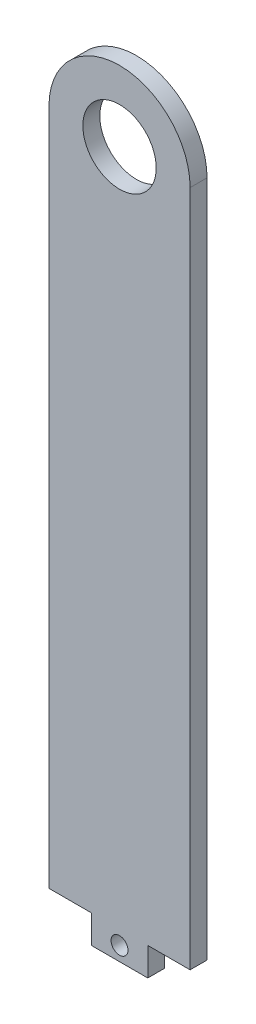
ISO-10303-21;
HEADER;
FILE_DESCRIPTION(('STEP AP214'),'2;1');
FILE_NAME('part.step','',(''),(''),'','','');
FILE_SCHEMA(('AUTOMOTIVE_DESIGN { 1 0 10303 214 1 1 1 1 }'));
ENDSEC;
DATA;
#1=APPLICATION_CONTEXT('core data for automotive mechanical design processes');
#2=APPLICATION_PROTOCOL_DEFINITION('international standard','automotive_design',2000,#1);
#3=PRODUCT_CONTEXT('',#1,'mechanical');
#4=PRODUCT('Part','Part','',(#3));
#5=PRODUCT_RELATED_PRODUCT_CATEGORY('part','',(#4));
#6=PRODUCT_DEFINITION_FORMATION('','',#4);
#7=PRODUCT_DEFINITION_CONTEXT('part definition',#1,'design');
#8=PRODUCT_DEFINITION('design','',#6,#7);
#9=PRODUCT_DEFINITION_SHAPE('','',#8);
#10=(LENGTH_UNIT() NAMED_UNIT(*) SI_UNIT(.MILLI.,.METRE.));
#11=(NAMED_UNIT(*) PLANE_ANGLE_UNIT() SI_UNIT($,.RADIAN.));
#12=(NAMED_UNIT(*) SI_UNIT($,.STERADIAN.) SOLID_ANGLE_UNIT());
#13=UNCERTAINTY_MEASURE_WITH_UNIT(LENGTH_MEASURE(1.E-05),#10,'distance_accuracy_value','');
#14=(GEOMETRIC_REPRESENTATION_CONTEXT(3) GLOBAL_UNCERTAINTY_ASSIGNED_CONTEXT((#13)) GLOBAL_UNIT_ASSIGNED_CONTEXT((#10,
#11,#12)) REPRESENTATION_CONTEXT('',''));
#15=CARTESIAN_POINT('',(0.,0.,0.));
#16=DIRECTION('',(0.,0.,1.));
#17=DIRECTION('',(1.,0.,0.));
#18=AXIS2_PLACEMENT_3D('',#15,#16,#17);
#19=CARTESIAN_POINT('',(-25.,-120.,6.));
#20=DIRECTION('',(0.,1.,0.));
#21=DIRECTION('',(0.,0.,1.));
#22=AXIS2_PLACEMENT_3D('',#19,#20,#21);
#23=PLANE('',#22);
#24=DIRECTION('',(0.,0.,-1.));
#25=VECTOR('',#24,1.);
#26=CARTESIAN_POINT('',(-10.,-120.,6.));
#27=LINE('',#26,#25);
#28=CARTESIAN_POINT('',(-10.,-120.,6.));
#29=VERTEX_POINT('',#28);
#30=CARTESIAN_POINT('',(-10.,-120.,0.));
#31=VERTEX_POINT('',#30);
#32=EDGE_CURVE('E109',#29,#31,#27,.T.);
#33=ORIENTED_EDGE('',*,*,#32,.F.);
#34=DIRECTION('',(1.,0.,0.));
#35=VECTOR('',#34,1.);
#36=CARTESIAN_POINT('',(-25.,-120.,6.));
#37=LINE('',#36,#35);
#38=CARTESIAN_POINT('',(-25.,-120.,6.));
#39=VERTEX_POINT('',#38);
#40=EDGE_CURVE('E122',#39,#29,#37,.T.);
#41=ORIENTED_EDGE('',*,*,#40,.F.);
#42=DIRECTION('',(0.,0.,-1.));
#43=VECTOR('',#42,1.);
#44=CARTESIAN_POINT('',(-25.,-120.,6.));
#45=LINE('',#44,#43);
#46=CARTESIAN_POINT('',(-25.,-120.,0.));
#47=VERTEX_POINT('',#46);
#48=EDGE_CURVE('E40',#39,#47,#45,.T.);
#49=ORIENTED_EDGE('',*,*,#48,.T.);
#50=DIRECTION('',(1.,0.,0.));
#51=VECTOR('',#50,1.);
#52=CARTESIAN_POINT('',(-25.,-120.,0.));
#53=LINE('',#52,#51);
#54=EDGE_CURVE('E124',#47,#31,#53,.T.);
#55=ORIENTED_EDGE('',*,*,#54,.T.);
#56=EDGE_LOOP('',(#33,#41,#49,#55));
#57=FACE_BOUND('',#56,.T.);
#58=ADVANCED_FACE('F32',(#57),#23,.F.);
#59=CARTESIAN_POINT('',(0.,120.,6.));
#60=DIRECTION('',(0.,0.,1.));
#61=DIRECTION('',(1.,0.,0.));
#62=AXIS2_PLACEMENT_3D('',#59,#60,#61);
#63=PLANE('',#62);
#64=CARTESIAN_POINT('',(0.,120.,6.));
#65=DIRECTION('',(0.,0.,1.));
#66=DIRECTION('',(1.,0.,0.));
#67=AXIS2_PLACEMENT_3D('',#64,#65,#66);
#68=CIRCLE('',#67,25.);
#69=CARTESIAN_POINT('',(25.,120.,6.));
#70=VERTEX_POINT('',#69);
#71=CARTESIAN_POINT('',(-25.,120.,6.));
#72=VERTEX_POINT('',#71);
#73=EDGE_CURVE('E146',#70,#72,#68,.T.);
#74=ORIENTED_EDGE('',*,*,#73,.T.);
#75=DIRECTION('',(0.,-1.,0.));
#76=VECTOR('',#75,1.);
#77=CARTESIAN_POINT('',(-25.,-120.,6.));
#78=LINE('',#77,#76);
#79=EDGE_CURVE('E84',#72,#39,#78,.T.);
#80=ORIENTED_EDGE('',*,*,#79,.T.);
#81=ORIENTED_EDGE('',*,*,#40,.T.);
#82=DIRECTION('',(0.,1.,0.));
#83=VECTOR('',#82,1.);
#84=CARTESIAN_POINT('',(-10.,-130.,6.));
#85=LINE('',#84,#83);
#86=CARTESIAN_POINT('',(-10.,-130.,6.));
#87=VERTEX_POINT('',#86);
#88=EDGE_CURVE('E105',#87,#29,#85,.T.);
#89=ORIENTED_EDGE('',*,*,#88,.F.);
#90=DIRECTION('',(-1.,0.,0.));
#91=VECTOR('',#90,1.);
#92=CARTESIAN_POINT('',(10.,-130.,6.));
#93=LINE('',#92,#91);
#94=CARTESIAN_POINT('',(10.,-130.,6.));
#95=VERTEX_POINT('',#94);
#96=EDGE_CURVE('E126',#95,#87,#93,.T.);
#97=ORIENTED_EDGE('',*,*,#96,.F.);
#98=DIRECTION('',(0.,-1.,0.));
#99=VECTOR('',#98,1.);
#100=CARTESIAN_POINT('',(10.,-130.,6.));
#101=LINE('',#100,#99);
#102=CARTESIAN_POINT('',(10.,-120.,6.));
#103=VERTEX_POINT('',#102);
#104=EDGE_CURVE('E115',#103,#95,#101,.T.);
#105=ORIENTED_EDGE('',*,*,#104,.F.);
#106=CARTESIAN_POINT('',(25.,-120.,6.));
#107=VERTEX_POINT('',#106);
#108=EDGE_CURVE('E130',#103,#107,#37,.T.);
#109=ORIENTED_EDGE('',*,*,#108,.T.);
#110=DIRECTION('',(0.,1.,0.));
#111=VECTOR('',#110,1.);
#112=CARTESIAN_POINT('',(25.,-120.,6.));
#113=LINE('',#112,#111);
#114=EDGE_CURVE('E56',#107,#70,#113,.T.);
#115=ORIENTED_EDGE('',*,*,#114,.T.);
#116=EDGE_LOOP('',(#74,#80,#81,#89,#97,#105,#109,#115));
#117=FACE_BOUND('',#116,.T.);
#118=CARTESIAN_POINT('',(0.,120.,6.));
#119=DIRECTION('',(0.,0.,1.));
#120=DIRECTION('',(1.,0.,0.));
#121=AXIS2_PLACEMENT_3D('',#118,#119,#120);
#122=CIRCLE('',#121,13.);
#123=CARTESIAN_POINT('',(13.,120.,6.));
#124=VERTEX_POINT('',#123);
#125=EDGE_CURVE('E141',#124,#124,#122,.T.);
#126=ORIENTED_EDGE('',*,*,#125,.F.);
#127=EDGE_LOOP('',(#126));
#128=FACE_BOUND('',#127,.T.);
#129=CARTESIAN_POINT('',(0.,-125.,6.));
#130=DIRECTION('',(0.,0.,-1.));
#131=DIRECTION('',(-1.,0.,0.));
#132=AXIS2_PLACEMENT_3D('',#129,#130,#131);
#133=CIRCLE('',#132,3.);
#134=CARTESIAN_POINT('',(-3.,-125.,6.));
#135=VERTEX_POINT('',#134);
#136=EDGE_CURVE('E156',#135,#135,#133,.T.);
#137=ORIENTED_EDGE('',*,*,#136,.T.);
#138=EDGE_LOOP('',(#137));
#139=FACE_BOUND('',#138,.T.);
#140=ADVANCED_FACE('F128',(#117,#128,#139),#63,.T.);
#141=CARTESIAN_POINT('',(0.,120.,0.));
#142=DIRECTION('',(0.,0.,1.));
#143=DIRECTION('',(1.,0.,0.));
#144=AXIS2_PLACEMENT_3D('',#141,#142,#143);
#145=PLANE('',#144);
#146=CARTESIAN_POINT('',(0.,120.,0.));
#147=DIRECTION('',(0.,0.,1.));
#148=DIRECTION('',(1.,0.,0.));
#149=AXIS2_PLACEMENT_3D('',#146,#147,#148);
#150=CIRCLE('',#149,25.);
#151=CARTESIAN_POINT('',(25.,120.,0.));
#152=VERTEX_POINT('',#151);
#153=CARTESIAN_POINT('',(-25.,120.,0.));
#154=VERTEX_POINT('',#153);
#155=EDGE_CURVE('E137',#152,#154,#150,.T.);
#156=ORIENTED_EDGE('',*,*,#155,.F.);
#157=DIRECTION('',(0.,1.,0.));
#158=VECTOR('',#157,1.);
#159=CARTESIAN_POINT('',(25.,-120.,0.));
#160=LINE('',#159,#158);
#161=CARTESIAN_POINT('',(25.,-120.,0.));
#162=VERTEX_POINT('',#161);
#163=EDGE_CURVE('E77',#162,#152,#160,.T.);
#164=ORIENTED_EDGE('',*,*,#163,.F.);
#165=CARTESIAN_POINT('',(10.,-120.,0.));
#166=VERTEX_POINT('',#165);
#167=EDGE_CURVE('E143',#166,#162,#53,.T.);
#168=ORIENTED_EDGE('',*,*,#167,.F.);
#169=DIRECTION('',(0.,-1.,0.));
#170=VECTOR('',#169,1.);
#171=CARTESIAN_POINT('',(10.,-130.,0.));
#172=LINE('',#171,#170);
#173=CARTESIAN_POINT('',(10.,-130.,0.));
#174=VERTEX_POINT('',#173);
#175=EDGE_CURVE('E47',#166,#174,#172,.T.);
#176=ORIENTED_EDGE('',*,*,#175,.T.);
#177=DIRECTION('',(-1.,0.,0.));
#178=VECTOR('',#177,1.);
#179=CARTESIAN_POINT('',(10.,-130.,0.));
#180=LINE('',#179,#178);
#181=CARTESIAN_POINT('',(-10.,-130.,0.));
#182=VERTEX_POINT('',#181);
#183=EDGE_CURVE('E116',#174,#182,#180,.T.);
#184=ORIENTED_EDGE('',*,*,#183,.T.);
#185=DIRECTION('',(0.,1.,0.));
#186=VECTOR('',#185,1.);
#187=CARTESIAN_POINT('',(-10.,-130.,0.));
#188=LINE('',#187,#186);
#189=EDGE_CURVE('E154',#182,#31,#188,.T.);
#190=ORIENTED_EDGE('',*,*,#189,.T.);
#191=ORIENTED_EDGE('',*,*,#54,.F.);
#192=DIRECTION('',(0.,-1.,0.));
#193=VECTOR('',#192,1.);
#194=CARTESIAN_POINT('',(-25.,-120.,0.));
#195=LINE('',#194,#193);
#196=EDGE_CURVE('E140',#154,#47,#195,.T.);
#197=ORIENTED_EDGE('',*,*,#196,.F.);
#198=EDGE_LOOP('',(#156,#164,#168,#176,#184,#190,#191,#197));
#199=FACE_BOUND('',#198,.T.);
#200=CARTESIAN_POINT('',(0.,120.,0.));
#201=DIRECTION('',(0.,0.,1.));
#202=DIRECTION('',(1.,0.,0.));
#203=AXIS2_PLACEMENT_3D('',#200,#201,#202);
#204=CIRCLE('',#203,13.);
#205=CARTESIAN_POINT('',(13.,120.,0.));
#206=VERTEX_POINT('',#205);
#207=EDGE_CURVE('E167',#206,#206,#204,.T.);
#208=ORIENTED_EDGE('',*,*,#207,.T.);
#209=EDGE_LOOP('',(#208));
#210=FACE_BOUND('',#209,.T.);
#211=CARTESIAN_POINT('',(0.,-125.,0.));
#212=DIRECTION('',(0.,0.,-1.));
#213=DIRECTION('',(-1.,0.,0.));
#214=AXIS2_PLACEMENT_3D('',#211,#212,#213);
#215=CIRCLE('',#214,3.);
#216=CARTESIAN_POINT('',(-3.,-125.,0.));
#217=VERTEX_POINT('',#216);
#218=EDGE_CURVE('E160',#217,#217,#215,.T.);
#219=ORIENTED_EDGE('',*,*,#218,.F.);
#220=EDGE_LOOP('',(#219));
#221=FACE_BOUND('',#220,.T.);
#222=ADVANCED_FACE('F151',(#199,#210,#221),#145,.F.);
#223=CARTESIAN_POINT('',(0.,120.,6.));
#224=DIRECTION('',(0.,0.,-1.));
#225=DIRECTION('',(-1.,0.,0.));
#226=AXIS2_PLACEMENT_3D('',#223,#224,#225);
#227=CYLINDRICAL_SURFACE('',#226,25.);
#228=ORIENTED_EDGE('',*,*,#155,.T.);
#229=DIRECTION('',(0.,0.,-1.));
#230=VECTOR('',#229,1.);
#231=CARTESIAN_POINT('',(-25.,120.,6.));
#232=LINE('',#231,#230);
#233=EDGE_CURVE('E11',#72,#154,#232,.T.);
#234=ORIENTED_EDGE('',*,*,#233,.F.);
#235=ORIENTED_EDGE('',*,*,#73,.F.);
#236=DIRECTION('',(0.,0.,-1.));
#237=VECTOR('',#236,1.);
#238=CARTESIAN_POINT('',(25.,120.,6.));
#239=LINE('',#238,#237);
#240=EDGE_CURVE('E132',#70,#152,#239,.T.);
#241=ORIENTED_EDGE('',*,*,#240,.T.);
#242=EDGE_LOOP('',(#228,#234,#235,#241));
#243=FACE_BOUND('',#242,.T.);
#244=ADVANCED_FACE('F34',(#243),#227,.T.);
#245=CARTESIAN_POINT('',(-25.,-120.,6.));
#246=DIRECTION('',(1.,0.,0.));
#247=DIRECTION('',(0.,0.,-1.));
#248=AXIS2_PLACEMENT_3D('',#245,#246,#247);
#249=PLANE('',#248);
#250=ORIENTED_EDGE('',*,*,#196,.T.);
#251=ORIENTED_EDGE('',*,*,#48,.F.);
#252=ORIENTED_EDGE('',*,*,#79,.F.);
#253=ORIENTED_EDGE('',*,*,#233,.T.);
#254=EDGE_LOOP('',(#250,#251,#252,#253));
#255=FACE_BOUND('',#254,.T.);
#256=ADVANCED_FACE('F177',(#255),#249,.F.);
#257=ORIENTED_EDGE('',*,*,#108,.F.);
#258=DIRECTION('',(0.,0.,-1.));
#259=VECTOR('',#258,1.);
#260=CARTESIAN_POINT('',(10.,-120.,6.));
#261=LINE('',#260,#259);
#262=EDGE_CURVE('E125',#103,#166,#261,.T.);
#263=ORIENTED_EDGE('',*,*,#262,.T.);
#264=ORIENTED_EDGE('',*,*,#167,.T.);
#265=DIRECTION('',(0.,0.,-1.));
#266=VECTOR('',#265,1.);
#267=CARTESIAN_POINT('',(25.,-120.,6.));
#268=LINE('',#267,#266);
#269=EDGE_CURVE('E148',#107,#162,#268,.T.);
#270=ORIENTED_EDGE('',*,*,#269,.F.);
#271=EDGE_LOOP('',(#257,#263,#264,#270));
#272=FACE_BOUND('',#271,.T.);
#273=ADVANCED_FACE('F179',(#272),#23,.F.);
#274=CARTESIAN_POINT('',(25.,-120.,6.));
#275=DIRECTION('',(-1.,0.,0.));
#276=DIRECTION('',(0.,0.,1.));
#277=AXIS2_PLACEMENT_3D('',#274,#275,#276);
#278=PLANE('',#277);
#279=ORIENTED_EDGE('',*,*,#163,.T.);
#280=ORIENTED_EDGE('',*,*,#240,.F.);
#281=ORIENTED_EDGE('',*,*,#114,.F.);
#282=ORIENTED_EDGE('',*,*,#269,.T.);
#283=EDGE_LOOP('',(#279,#280,#281,#282));
#284=FACE_BOUND('',#283,.T.);
#285=ADVANCED_FACE('F184',(#284),#278,.F.);
#286=CARTESIAN_POINT('',(0.,120.,6.));
#287=DIRECTION('',(0.,0.,-1.));
#288=DIRECTION('',(-1.,0.,0.));
#289=AXIS2_PLACEMENT_3D('',#286,#287,#288);
#290=CYLINDRICAL_SURFACE('',#289,13.);
#291=ORIENTED_EDGE('',*,*,#125,.T.);
#292=EDGE_LOOP('',(#291));
#293=FACE_BOUND('',#292,.T.);
#294=ORIENTED_EDGE('',*,*,#207,.F.);
#295=EDGE_LOOP('',(#294));
#296=FACE_BOUND('',#295,.T.);
#297=ADVANCED_FACE('F195',(#293,#296),#290,.F.);
#298=CARTESIAN_POINT('',(-10.,-130.,6.));
#299=DIRECTION('',(-1.,0.,0.));
#300=DIRECTION('',(0.,0.,1.));
#301=AXIS2_PLACEMENT_3D('',#298,#299,#300);
#302=PLANE('',#301);
#303=ORIENTED_EDGE('',*,*,#189,.F.);
#304=DIRECTION('',(0.,0.,-1.));
#305=VECTOR('',#304,1.);
#306=CARTESIAN_POINT('',(-10.,-130.,6.));
#307=LINE('',#306,#305);
#308=EDGE_CURVE('E111',#87,#182,#307,.T.);
#309=ORIENTED_EDGE('',*,*,#308,.F.);
#310=ORIENTED_EDGE('',*,*,#88,.T.);
#311=ORIENTED_EDGE('',*,*,#32,.T.);
#312=EDGE_LOOP('',(#303,#309,#310,#311));
#313=FACE_BOUND('',#312,.T.);
#314=ADVANCED_FACE('F108',(#313),#302,.T.);
#315=CARTESIAN_POINT('',(10.,-130.,6.));
#316=DIRECTION('',(0.,-1.,0.));
#317=DIRECTION('',(0.,0.,-1.));
#318=AXIS2_PLACEMENT_3D('',#315,#316,#317);
#319=PLANE('',#318);
#320=ORIENTED_EDGE('',*,*,#183,.F.);
#321=DIRECTION('',(0.,0.,-1.));
#322=VECTOR('',#321,1.);
#323=CARTESIAN_POINT('',(10.,-130.,6.));
#324=LINE('',#323,#322);
#325=EDGE_CURVE('E168',#95,#174,#324,.T.);
#326=ORIENTED_EDGE('',*,*,#325,.F.);
#327=ORIENTED_EDGE('',*,*,#96,.T.);
#328=ORIENTED_EDGE('',*,*,#308,.T.);
#329=EDGE_LOOP('',(#320,#326,#327,#328));
#330=FACE_BOUND('',#329,.T.);
#331=ADVANCED_FACE('F203',(#330),#319,.T.);
#332=CARTESIAN_POINT('',(10.,-130.,6.));
#333=DIRECTION('',(1.,0.,0.));
#334=DIRECTION('',(0.,0.,-1.));
#335=AXIS2_PLACEMENT_3D('',#332,#333,#334);
#336=PLANE('',#335);
#337=ORIENTED_EDGE('',*,*,#175,.F.);
#338=ORIENTED_EDGE('',*,*,#262,.F.);
#339=ORIENTED_EDGE('',*,*,#104,.T.);
#340=ORIENTED_EDGE('',*,*,#325,.T.);
#341=EDGE_LOOP('',(#337,#338,#339,#340));
#342=FACE_BOUND('',#341,.T.);
#343=ADVANCED_FACE('F204',(#342),#336,.T.);
#344=CARTESIAN_POINT('',(0.,-125.,6.));
#345=DIRECTION('',(0.,0.,-1.));
#346=DIRECTION('',(-1.,0.,0.));
#347=AXIS2_PLACEMENT_3D('',#344,#345,#346);
#348=CYLINDRICAL_SURFACE('',#347,3.);
#349=ORIENTED_EDGE('',*,*,#136,.F.);
#350=EDGE_LOOP('',(#349));
#351=FACE_BOUND('',#350,.T.);
#352=ORIENTED_EDGE('',*,*,#218,.T.);
#353=EDGE_LOOP('',(#352));
#354=FACE_BOUND('',#353,.T.);
#355=ADVANCED_FACE('F207',(#351,#354),#348,.F.);
#356=CLOSED_SHELL('',(#58,#140,#222,#244,#256,#273,#285,#297,#314,#331,#343,#355));
#357=MANIFOLD_SOLID_BREP('B2',#356);
#358=ADVANCED_BREP_SHAPE_REPRESENTATION('',(#18,#357),#14);
#359=SHAPE_DEFINITION_REPRESENTATION(#9,#358);
ENDSEC;
END-ISO-10303-21;
